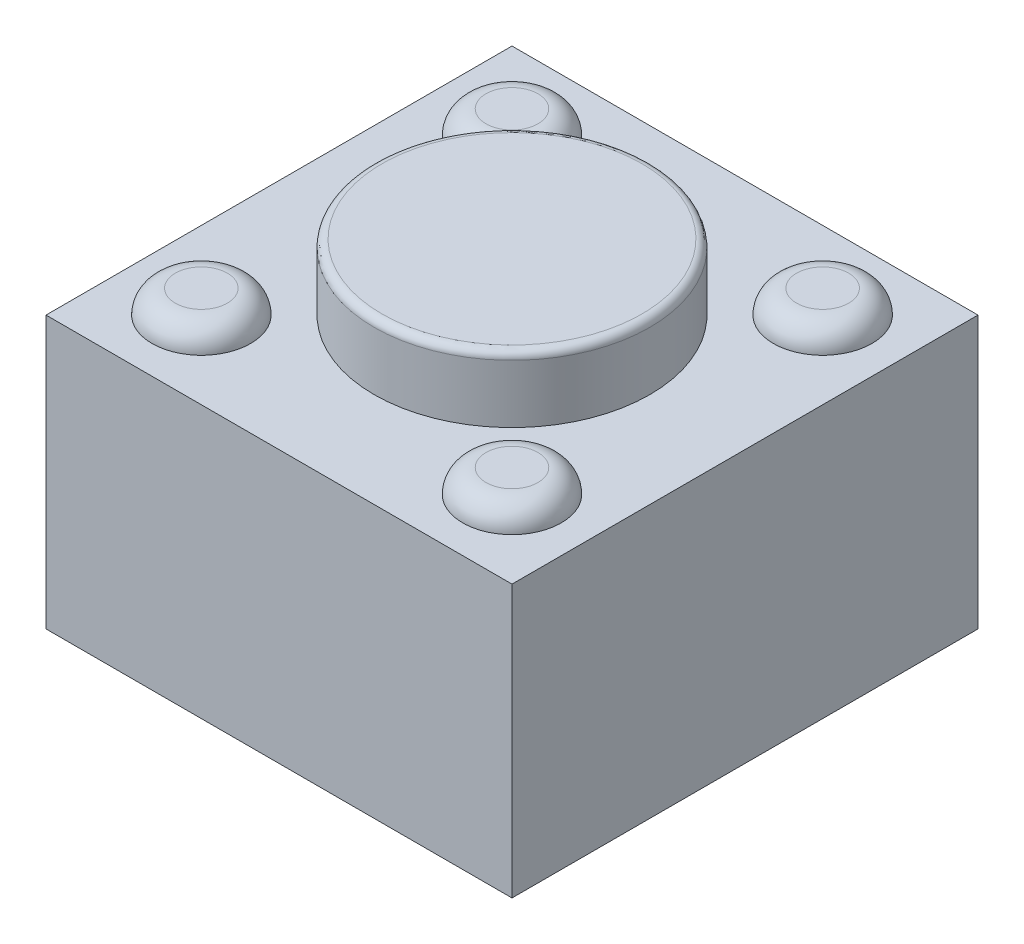
ISO-10303-21;
HEADER;
FILE_DESCRIPTION(('STEP AP214'),'2;1');
FILE_NAME('part.step','',(''),(''),'','','');
FILE_SCHEMA(('AUTOMOTIVE_DESIGN { 1 0 10303 214 1 1 1 1 }'));
ENDSEC;
DATA;
#1=APPLICATION_CONTEXT('core data for automotive mechanical design processes');
#2=APPLICATION_PROTOCOL_DEFINITION('international standard','automotive_design',2000,#1);
#3=PRODUCT_CONTEXT('',#1,'mechanical');
#4=PRODUCT('Part','Part','',(#3));
#5=PRODUCT_RELATED_PRODUCT_CATEGORY('part','',(#4));
#6=PRODUCT_DEFINITION_FORMATION('','',#4);
#7=PRODUCT_DEFINITION_CONTEXT('part definition',#1,'design');
#8=PRODUCT_DEFINITION('design','',#6,#7);
#9=PRODUCT_DEFINITION_SHAPE('','',#8);
#10=(LENGTH_UNIT() NAMED_UNIT(*) SI_UNIT(.MILLI.,.METRE.));
#11=(NAMED_UNIT(*) PLANE_ANGLE_UNIT() SI_UNIT($,.RADIAN.));
#12=(NAMED_UNIT(*) SI_UNIT($,.STERADIAN.) SOLID_ANGLE_UNIT());
#13=UNCERTAINTY_MEASURE_WITH_UNIT(LENGTH_MEASURE(1.E-05),#10,'distance_accuracy_value','');
#14=(GEOMETRIC_REPRESENTATION_CONTEXT(3) GLOBAL_UNCERTAINTY_ASSIGNED_CONTEXT((#13)) GLOBAL_UNIT_ASSIGNED_CONTEXT((#10,
#11,#12)) REPRESENTATION_CONTEXT('',''));
#15=CARTESIAN_POINT('',(0.,0.,0.));
#16=DIRECTION('',(0.,0.,1.));
#17=DIRECTION('',(1.,0.,0.));
#18=AXIS2_PLACEMENT_3D('',#15,#16,#17);
#19=CARTESIAN_POINT('',(3.,3.5,3.));
#20=DIRECTION('',(-1.,0.,0.));
#21=DIRECTION('',(0.,0.,1.));
#22=AXIS2_PLACEMENT_3D('',#19,#20,#21);
#23=PLANE('',#22);
#24=DIRECTION('',(0.,0.,-1.));
#25=VECTOR('',#24,1.);
#26=CARTESIAN_POINT('',(3.,0.,3.));
#27=LINE('',#26,#25);
#28=CARTESIAN_POINT('',(3.,0.,3.));
#29=VERTEX_POINT('',#28);
#30=CARTESIAN_POINT('',(3.,0.,-3.));
#31=VERTEX_POINT('',#30);
#32=EDGE_CURVE('E103',#29,#31,#27,.T.);
#33=ORIENTED_EDGE('',*,*,#32,.T.);
#34=DIRECTION('',(0.,-1.,0.));
#35=VECTOR('',#34,1.);
#36=CARTESIAN_POINT('',(3.,3.5,-3.));
#37=LINE('',#36,#35);
#38=CARTESIAN_POINT('',(3.,3.5,-3.));
#39=VERTEX_POINT('',#38);
#40=EDGE_CURVE('E94',#39,#31,#37,.T.);
#41=ORIENTED_EDGE('',*,*,#40,.F.);
#42=DIRECTION('',(0.,0.,-1.));
#43=VECTOR('',#42,1.);
#44=CARTESIAN_POINT('',(3.,3.5,3.));
#45=LINE('',#44,#43);
#46=CARTESIAN_POINT('',(3.,3.5,3.));
#47=VERTEX_POINT('',#46);
#48=EDGE_CURVE('E88',#47,#39,#45,.T.);
#49=ORIENTED_EDGE('',*,*,#48,.F.);
#50=DIRECTION('',(0.,-1.,0.));
#51=VECTOR('',#50,1.);
#52=CARTESIAN_POINT('',(3.,3.5,3.));
#53=LINE('',#52,#51);
#54=EDGE_CURVE('E99',#47,#29,#53,.T.);
#55=ORIENTED_EDGE('',*,*,#54,.T.);
#56=EDGE_LOOP('',(#33,#41,#49,#55));
#57=FACE_BOUND('',#56,.T.);
#58=ADVANCED_FACE('F35',(#57),#23,.F.);
#59=CARTESIAN_POINT('',(-3.,3.5,-3.));
#60=DIRECTION('',(0.,0.,1.));
#61=DIRECTION('',(1.,0.,0.));
#62=AXIS2_PLACEMENT_3D('',#59,#60,#61);
#63=PLANE('',#62);
#64=DIRECTION('',(-1.,0.,0.));
#65=VECTOR('',#64,1.);
#66=CARTESIAN_POINT('',(-3.,0.,-3.));
#67=LINE('',#66,#65);
#68=CARTESIAN_POINT('',(-3.,0.,-3.));
#69=VERTEX_POINT('',#68);
#70=EDGE_CURVE('E93',#31,#69,#67,.T.);
#71=ORIENTED_EDGE('',*,*,#70,.T.);
#72=DIRECTION('',(0.,-1.,0.));
#73=VECTOR('',#72,1.);
#74=CARTESIAN_POINT('',(-3.,3.5,-3.));
#75=LINE('',#74,#73);
#76=CARTESIAN_POINT('',(-3.,3.5,-3.));
#77=VERTEX_POINT('',#76);
#78=EDGE_CURVE('E91',#77,#69,#75,.T.);
#79=ORIENTED_EDGE('',*,*,#78,.F.);
#80=DIRECTION('',(-1.,0.,0.));
#81=VECTOR('',#80,1.);
#82=CARTESIAN_POINT('',(-3.,3.5,-3.));
#83=LINE('',#82,#81);
#84=EDGE_CURVE('E83',#39,#77,#83,.T.);
#85=ORIENTED_EDGE('',*,*,#84,.F.);
#86=ORIENTED_EDGE('',*,*,#40,.T.);
#87=EDGE_LOOP('',(#71,#79,#85,#86));
#88=FACE_BOUND('',#87,.T.);
#89=ADVANCED_FACE('F92',(#88),#63,.F.);
#90=CARTESIAN_POINT('',(-3.,3.5,3.));
#91=DIRECTION('',(1.,0.,0.));
#92=DIRECTION('',(0.,0.,-1.));
#93=AXIS2_PLACEMENT_3D('',#90,#91,#92);
#94=PLANE('',#93);
#95=DIRECTION('',(0.,0.,1.));
#96=VECTOR('',#95,1.);
#97=CARTESIAN_POINT('',(-3.,0.,3.));
#98=LINE('',#97,#96);
#99=CARTESIAN_POINT('',(-3.,0.,3.));
#100=VERTEX_POINT('',#99);
#101=EDGE_CURVE('E69',#69,#100,#98,.T.);
#102=ORIENTED_EDGE('',*,*,#101,.T.);
#103=DIRECTION('',(0.,-1.,0.));
#104=VECTOR('',#103,1.);
#105=CARTESIAN_POINT('',(-3.,3.5,3.));
#106=LINE('',#105,#104);
#107=CARTESIAN_POINT('',(-3.,3.5,3.));
#108=VERTEX_POINT('',#107);
#109=EDGE_CURVE('E95',#108,#100,#106,.T.);
#110=ORIENTED_EDGE('',*,*,#109,.F.);
#111=DIRECTION('',(0.,0.,1.));
#112=VECTOR('',#111,1.);
#113=CARTESIAN_POINT('',(-3.,3.5,3.));
#114=LINE('',#113,#112);
#115=EDGE_CURVE('E86',#77,#108,#114,.T.);
#116=ORIENTED_EDGE('',*,*,#115,.F.);
#117=ORIENTED_EDGE('',*,*,#78,.T.);
#118=EDGE_LOOP('',(#102,#110,#116,#117));
#119=FACE_BOUND('',#118,.T.);
#120=ADVANCED_FACE('F97',(#119),#94,.F.);
#121=CARTESIAN_POINT('',(-3.,3.5,3.));
#122=DIRECTION('',(0.,0.,-1.));
#123=DIRECTION('',(-1.,0.,0.));
#124=AXIS2_PLACEMENT_3D('',#121,#122,#123);
#125=PLANE('',#124);
#126=DIRECTION('',(1.,0.,0.));
#127=VECTOR('',#126,1.);
#128=CARTESIAN_POINT('',(-3.,0.,3.));
#129=LINE('',#128,#127);
#130=EDGE_CURVE('E75',#100,#29,#129,.T.);
#131=ORIENTED_EDGE('',*,*,#130,.T.);
#132=ORIENTED_EDGE('',*,*,#54,.F.);
#133=DIRECTION('',(1.,0.,0.));
#134=VECTOR('',#133,1.);
#135=CARTESIAN_POINT('',(-3.,3.5,3.));
#136=LINE('',#135,#134);
#137=EDGE_CURVE('E52',#108,#47,#136,.T.);
#138=ORIENTED_EDGE('',*,*,#137,.F.);
#139=ORIENTED_EDGE('',*,*,#109,.T.);
#140=EDGE_LOOP('',(#131,#132,#138,#139));
#141=FACE_BOUND('',#140,.T.);
#142=ADVANCED_FACE('F203',(#141),#125,.F.);
#143=CARTESIAN_POINT('',(0.,3.5,0.));
#144=DIRECTION('',(0.,-1.,0.));
#145=DIRECTION('',(0.,0.,-1.));
#146=AXIS2_PLACEMENT_3D('',#143,#144,#145);
#147=PLANE('',#146);
#148=CARTESIAN_POINT('',(2.,3.5,2.));
#149=DIRECTION('',(0.,-1.,0.));
#150=DIRECTION('',(0.,0.,-1.));
#151=AXIS2_PLACEMENT_3D('',#148,#149,#150);
#152=CIRCLE('',#151,0.635);
#153=CARTESIAN_POINT('',(2.,3.5,1.365));
#154=VERTEX_POINT('',#153);
#155=EDGE_CURVE('E130',#154,#154,#152,.F.);
#156=ORIENTED_EDGE('',*,*,#155,.F.);
#157=EDGE_LOOP('',(#156));
#158=FACE_BOUND('',#157,.T.);
#159=CARTESIAN_POINT('',(-2.,3.5,2.));
#160=DIRECTION('',(0.,-1.,0.));
#161=DIRECTION('',(0.,0.,-1.));
#162=AXIS2_PLACEMENT_3D('',#159,#160,#161);
#163=CIRCLE('',#162,0.635);
#164=CARTESIAN_POINT('',(-2.,3.5,1.365));
#165=VERTEX_POINT('',#164);
#166=EDGE_CURVE('E127',#165,#165,#163,.F.);
#167=ORIENTED_EDGE('',*,*,#166,.F.);
#168=EDGE_LOOP('',(#167));
#169=FACE_BOUND('',#168,.T.);
#170=CARTESIAN_POINT('',(-2.,3.5,-2.));
#171=DIRECTION('',(0.,-1.,0.));
#172=DIRECTION('',(0.,0.,-1.));
#173=AXIS2_PLACEMENT_3D('',#170,#171,#172);
#174=CIRCLE('',#173,0.635);
#175=CARTESIAN_POINT('',(-2.,3.5,-2.635));
#176=VERTEX_POINT('',#175);
#177=EDGE_CURVE('E124',#176,#176,#174,.F.);
#178=ORIENTED_EDGE('',*,*,#177,.F.);
#179=EDGE_LOOP('',(#178));
#180=FACE_BOUND('',#179,.T.);
#181=CARTESIAN_POINT('',(2.,3.5,-2.));
#182=DIRECTION('',(0.,-1.,0.));
#183=DIRECTION('',(0.,0.,-1.));
#184=AXIS2_PLACEMENT_3D('',#181,#182,#183);
#185=CIRCLE('',#184,0.635);
#186=CARTESIAN_POINT('',(2.,3.5,-2.635));
#187=VERTEX_POINT('',#186);
#188=EDGE_CURVE('E121',#187,#187,#185,.F.);
#189=ORIENTED_EDGE('',*,*,#188,.F.);
#190=EDGE_LOOP('',(#189));
#191=FACE_BOUND('',#190,.T.);
#192=CARTESIAN_POINT('',(0.,3.5,0.));
#193=DIRECTION('',(0.,-1.,0.));
#194=DIRECTION('',(0.,0.,-1.));
#195=AXIS2_PLACEMENT_3D('',#192,#193,#194);
#196=CIRCLE('',#195,1.775);
#197=CARTESIAN_POINT('',(0.,3.5,-1.775));
#198=VERTEX_POINT('',#197);
#199=EDGE_CURVE('E112',#198,#198,#196,.F.);
#200=ORIENTED_EDGE('',*,*,#199,.F.);
#201=EDGE_LOOP('',(#200));
#202=FACE_BOUND('',#201,.T.);
#203=ORIENTED_EDGE('',*,*,#48,.T.);
#204=ORIENTED_EDGE('',*,*,#84,.T.);
#205=ORIENTED_EDGE('',*,*,#115,.T.);
#206=ORIENTED_EDGE('',*,*,#137,.T.);
#207=EDGE_LOOP('',(#203,#204,#205,#206));
#208=FACE_BOUND('',#207,.T.);
#209=ADVANCED_FACE('F84',(#158,#169,#180,#191,#202,#208),#147,.F.);
#210=CARTESIAN_POINT('',(0.,0.,0.));
#211=DIRECTION('',(0.,-1.,0.));
#212=DIRECTION('',(0.,0.,-1.));
#213=AXIS2_PLACEMENT_3D('',#210,#211,#212);
#214=PLANE('',#213);
#215=ORIENTED_EDGE('',*,*,#32,.F.);
#216=ORIENTED_EDGE('',*,*,#130,.F.);
#217=ORIENTED_EDGE('',*,*,#101,.F.);
#218=ORIENTED_EDGE('',*,*,#70,.F.);
#219=EDGE_LOOP('',(#215,#216,#217,#218));
#220=FACE_BOUND('',#219,.T.);
#221=ADVANCED_FACE('F199',(#220),#214,.T.);
#222=CARTESIAN_POINT('',(0.,4.35,0.));
#223=DIRECTION('',(0.,-1.,0.));
#224=DIRECTION('',(0.,0.,-1.));
#225=AXIS2_PLACEMENT_3D('',#222,#223,#224);
#226=CYLINDRICAL_SURFACE('',#225,1.775);
#227=CARTESIAN_POINT('',(0.,4.25,0.));
#228=DIRECTION('',(0.,1.,0.));
#229=DIRECTION('',(0.,0.,1.));
#230=AXIS2_PLACEMENT_3D('',#227,#228,#229);
#231=CIRCLE('',#230,1.775);
#232=CARTESIAN_POINT('',(0.,4.25,1.775));
#233=VERTEX_POINT('',#232);
#234=EDGE_CURVE('E118',#233,#233,#231,.F.);
#235=ORIENTED_EDGE('',*,*,#234,.T.);
#236=EDGE_LOOP('',(#235));
#237=FACE_BOUND('',#236,.T.);
#238=ORIENTED_EDGE('',*,*,#199,.T.);
#239=EDGE_LOOP('',(#238));
#240=FACE_BOUND('',#239,.T.);
#241=ADVANCED_FACE('F195',(#237,#240),#226,.T.);
#242=CARTESIAN_POINT('',(0.,4.35,0.));
#243=DIRECTION('',(0.,1.,0.));
#244=DIRECTION('',(0.,0.,1.));
#245=AXIS2_PLACEMENT_3D('',#242,#243,#244);
#246=PLANE('',#245);
#247=CARTESIAN_POINT('',(0.,4.35,0.));
#248=DIRECTION('',(0.,1.,0.));
#249=DIRECTION('',(0.,0.,1.));
#250=AXIS2_PLACEMENT_3D('',#247,#248,#249);
#251=CIRCLE('',#250,1.675);
#252=CARTESIAN_POINT('',(0.,4.35,1.675));
#253=VERTEX_POINT('',#252);
#254=EDGE_CURVE('E115',#253,#253,#251,.T.);
#255=ORIENTED_EDGE('',*,*,#254,.T.);
#256=EDGE_LOOP('',(#255));
#257=FACE_BOUND('',#256,.T.);
#258=ADVANCED_FACE('F167',(#257),#246,.T.);
#259=CARTESIAN_POINT('',(0.,4.25,0.));
#260=DIRECTION('',(0.,1.,0.));
#261=DIRECTION('',(0.,0.,1.));
#262=AXIS2_PLACEMENT_3D('',#259,#260,#261);
#263=TOROIDAL_SURFACE('',#262,1.675,0.1);
#264=ORIENTED_EDGE('',*,*,#234,.F.);
#265=EDGE_LOOP('',(#264));
#266=FACE_BOUND('',#265,.T.);
#267=ORIENTED_EDGE('',*,*,#254,.F.);
#268=EDGE_LOOP('',(#267));
#269=FACE_BOUND('',#268,.T.);
#270=ADVANCED_FACE('F164',(#266,#269),#263,.T.);
#271=CARTESIAN_POINT('',(2.,3.8,-2.));
#272=DIRECTION('',(0.,1.,0.));
#273=DIRECTION('',(0.,0.,1.));
#274=AXIS2_PLACEMENT_3D('',#271,#272,#273);
#275=PLANE('',#274);
#276=CARTESIAN_POINT('',(2.,3.8,-2.));
#277=DIRECTION('',(0.,1.,0.));
#278=DIRECTION('',(0.,0.,1.));
#279=AXIS2_PLACEMENT_3D('',#276,#277,#278);
#280=CIRCLE('',#279,0.335);
#281=CARTESIAN_POINT('',(2.,3.8,-1.665));
#282=VERTEX_POINT('',#281);
#283=EDGE_CURVE('E44',#282,#282,#280,.T.);
#284=ORIENTED_EDGE('',*,*,#283,.T.);
#285=EDGE_LOOP('',(#284));
#286=FACE_BOUND('',#285,.T.);
#287=ADVANCED_FACE('F141',(#286),#275,.T.);
#288=CARTESIAN_POINT('',(-2.,3.8,-2.));
#289=DIRECTION('',(0.,-1.,0.));
#290=DIRECTION('',(0.,0.,-1.));
#291=AXIS2_PLACEMENT_3D('',#288,#289,#290);
#292=PLANE('',#291);
#293=CARTESIAN_POINT('',(-2.,3.8,-2.));
#294=DIRECTION('',(0.,-1.,0.));
#295=DIRECTION('',(0.,0.,-1.));
#296=AXIS2_PLACEMENT_3D('',#293,#294,#295);
#297=CIRCLE('',#296,0.335);
#298=CARTESIAN_POINT('',(-2.,3.8,-2.335));
#299=VERTEX_POINT('',#298);
#300=EDGE_CURVE('E11',#299,#299,#297,.F.);
#301=ORIENTED_EDGE('',*,*,#300,.T.);
#302=EDGE_LOOP('',(#301));
#303=FACE_BOUND('',#302,.T.);
#304=ADVANCED_FACE('F183',(#303),#292,.F.);
#305=CARTESIAN_POINT('',(-2.,3.8,2.));
#306=DIRECTION('',(0.,1.,0.));
#307=DIRECTION('',(0.,0.,1.));
#308=AXIS2_PLACEMENT_3D('',#305,#306,#307);
#309=PLANE('',#308);
#310=CARTESIAN_POINT('',(-2.,3.8,2.));
#311=DIRECTION('',(0.,1.,0.));
#312=DIRECTION('',(0.,0.,1.));
#313=AXIS2_PLACEMENT_3D('',#310,#311,#312);
#314=CIRCLE('',#313,0.335);
#315=CARTESIAN_POINT('',(-2.,3.8,2.335));
#316=VERTEX_POINT('',#315);
#317=EDGE_CURVE('E133',#316,#316,#314,.T.);
#318=ORIENTED_EDGE('',*,*,#317,.T.);
#319=EDGE_LOOP('',(#318));
#320=FACE_BOUND('',#319,.T.);
#321=ADVANCED_FACE('F175',(#320),#309,.T.);
#322=CARTESIAN_POINT('',(2.,3.8,2.));
#323=DIRECTION('',(0.,-1.,0.));
#324=DIRECTION('',(0.,0.,-1.));
#325=AXIS2_PLACEMENT_3D('',#322,#323,#324);
#326=PLANE('',#325);
#327=CARTESIAN_POINT('',(2.,3.8,2.));
#328=DIRECTION('',(0.,-1.,0.));
#329=DIRECTION('',(0.,0.,-1.));
#330=AXIS2_PLACEMENT_3D('',#327,#328,#329);
#331=CIRCLE('',#330,0.335);
#332=CARTESIAN_POINT('',(2.,3.8,1.665));
#333=VERTEX_POINT('',#332);
#334=EDGE_CURVE('E136',#333,#333,#331,.F.);
#335=ORIENTED_EDGE('',*,*,#334,.T.);
#336=EDGE_LOOP('',(#335));
#337=FACE_BOUND('',#336,.T.);
#338=ADVANCED_FACE('F170',(#337),#326,.F.);
#339=CARTESIAN_POINT('',(-2.,3.5,2.));
#340=DIRECTION('',(0.,1.,0.));
#341=DIRECTION('',(0.,0.,1.));
#342=AXIS2_PLACEMENT_3D('',#339,#340,#341);
#343=TOROIDAL_SURFACE('',#342,0.335,0.3);
#344=ORIENTED_EDGE('',*,*,#166,.T.);
#345=EDGE_LOOP('',(#344));
#346=FACE_BOUND('',#345,.T.);
#347=ORIENTED_EDGE('',*,*,#317,.F.);
#348=EDGE_LOOP('',(#347));
#349=FACE_BOUND('',#348,.T.);
#350=ADVANCED_FACE('F152',(#346,#349),#343,.T.);
#351=CARTESIAN_POINT('',(2.,3.5,2.));
#352=DIRECTION('',(0.,-1.,0.));
#353=DIRECTION('',(0.,0.,-1.));
#354=AXIS2_PLACEMENT_3D('',#351,#352,#353);
#355=TOROIDAL_SURFACE('',#354,0.335,0.3);
#356=ORIENTED_EDGE('',*,*,#155,.T.);
#357=EDGE_LOOP('',(#356));
#358=FACE_BOUND('',#357,.T.);
#359=ORIENTED_EDGE('',*,*,#334,.F.);
#360=EDGE_LOOP('',(#359));
#361=FACE_BOUND('',#360,.T.);
#362=ADVANCED_FACE('F145',(#358,#361),#355,.T.);
#363=CARTESIAN_POINT('',(2.,3.5,-2.));
#364=DIRECTION('',(0.,1.,0.));
#365=DIRECTION('',(0.,0.,1.));
#366=AXIS2_PLACEMENT_3D('',#363,#364,#365);
#367=TOROIDAL_SURFACE('',#366,0.335,0.3);
#368=ORIENTED_EDGE('',*,*,#188,.T.);
#369=EDGE_LOOP('',(#368));
#370=FACE_BOUND('',#369,.T.);
#371=ORIENTED_EDGE('',*,*,#283,.F.);
#372=EDGE_LOOP('',(#371));
#373=FACE_BOUND('',#372,.T.);
#374=ADVANCED_FACE('F143',(#370,#373),#367,.T.);
#375=CARTESIAN_POINT('',(-2.,3.5,-2.));
#376=DIRECTION('',(0.,-1.,0.));
#377=DIRECTION('',(0.,0.,-1.));
#378=AXIS2_PLACEMENT_3D('',#375,#376,#377);
#379=TOROIDAL_SURFACE('',#378,0.335,0.3);
#380=ORIENTED_EDGE('',*,*,#177,.T.);
#381=EDGE_LOOP('',(#380));
#382=FACE_BOUND('',#381,.T.);
#383=ORIENTED_EDGE('',*,*,#300,.F.);
#384=EDGE_LOOP('',(#383));
#385=FACE_BOUND('',#384,.T.);
#386=ADVANCED_FACE('F37',(#382,#385),#379,.T.);
#387=CLOSED_SHELL('',(#58,#89,#120,#142,#209,#221,#241,#258,#270,#287,#304,#321,#338,#350,#362,
#374,#386));
#388=MANIFOLD_SOLID_BREP('B2',#387);
#389=ADVANCED_BREP_SHAPE_REPRESENTATION('',(#18,#388),#14);
#390=SHAPE_DEFINITION_REPRESENTATION(#9,#389);
ENDSEC;
END-ISO-10303-21;
